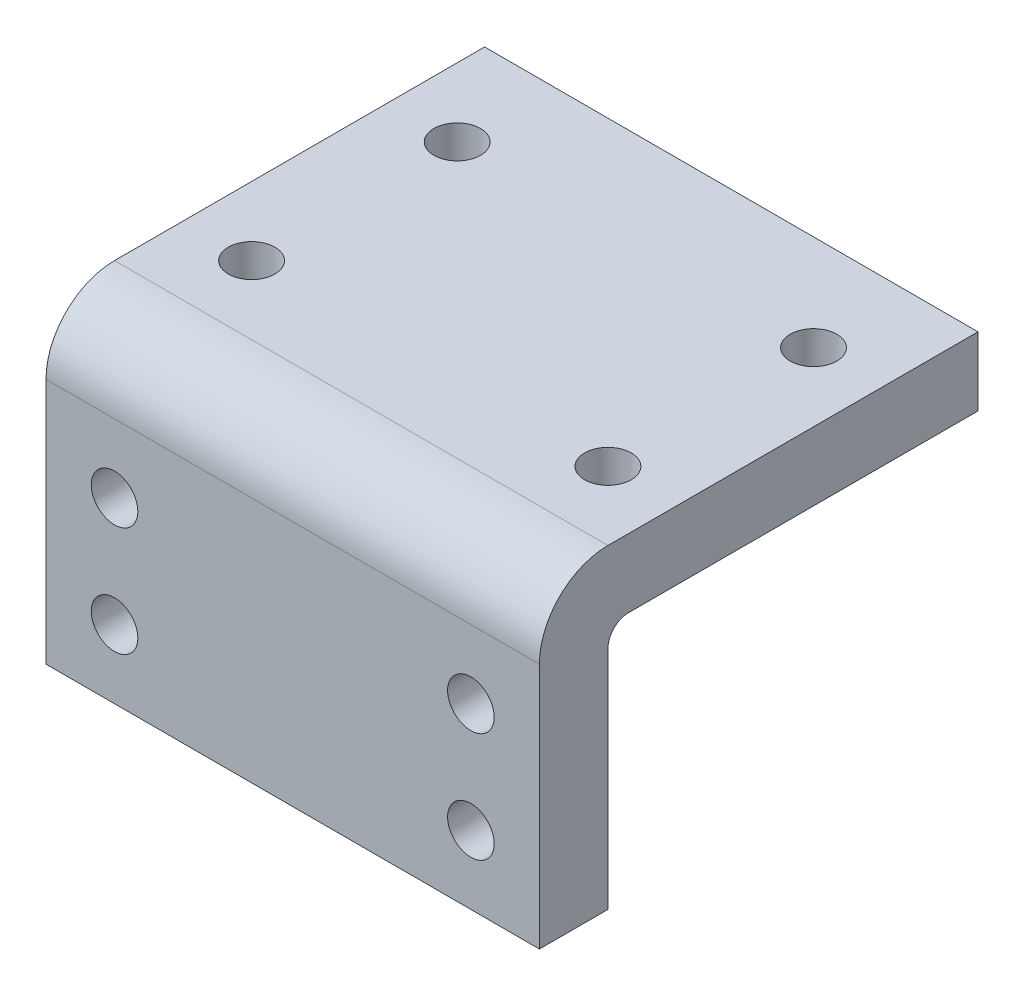
ISO-10303-21;
HEADER;
FILE_DESCRIPTION(('STEP AP214'),'2;1');
FILE_NAME('part.step','',(''),(''),'','','');
FILE_SCHEMA(('AUTOMOTIVE_DESIGN { 1 0 10303 214 1 1 1 1 }'));
ENDSEC;
DATA;
#1=APPLICATION_CONTEXT('core data for automotive mechanical design processes');
#2=APPLICATION_PROTOCOL_DEFINITION('international standard','automotive_design',2000,#1);
#3=PRODUCT_CONTEXT('',#1,'mechanical');
#4=PRODUCT('Part','Part','',(#3));
#5=PRODUCT_RELATED_PRODUCT_CATEGORY('part','',(#4));
#6=PRODUCT_DEFINITION_FORMATION('','',#4);
#7=PRODUCT_DEFINITION_CONTEXT('part definition',#1,'design');
#8=PRODUCT_DEFINITION('design','',#6,#7);
#9=PRODUCT_DEFINITION_SHAPE('','',#8);
#10=(LENGTH_UNIT() NAMED_UNIT(*) SI_UNIT(.MILLI.,.METRE.));
#11=(NAMED_UNIT(*) PLANE_ANGLE_UNIT() SI_UNIT($,.RADIAN.));
#12=(NAMED_UNIT(*) SI_UNIT($,.STERADIAN.) SOLID_ANGLE_UNIT());
#13=UNCERTAINTY_MEASURE_WITH_UNIT(LENGTH_MEASURE(1.E-05),#10,'distance_accuracy_value','');
#14=(GEOMETRIC_REPRESENTATION_CONTEXT(3) GLOBAL_UNCERTAINTY_ASSIGNED_CONTEXT((#13)) GLOBAL_UNIT_ASSIGNED_CONTEXT((#10,
#11,#12)) REPRESENTATION_CONTEXT('',''));
#15=CARTESIAN_POINT('',(0.,0.,0.));
#16=DIRECTION('',(0.,0.,1.));
#17=DIRECTION('',(1.,0.,0.));
#18=AXIS2_PLACEMENT_3D('',#15,#16,#17);
#19=CARTESIAN_POINT('',(0.,0.,0.));
#20=DIRECTION('',(0.,0.,1.));
#21=DIRECTION('',(1.,0.,0.));
#22=AXIS2_PLACEMENT_3D('',#19,#20,#21);
#23=PLANE('',#22);
#24=DIRECTION('',(0.,-1.,0.));
#25=VECTOR('',#24,1.);
#26=CARTESIAN_POINT('',(0.,18.,0.));
#27=LINE('',#26,#25);
#28=CARTESIAN_POINT('',(0.,16.5,0.));
#29=VERTEX_POINT('',#28);
#30=CARTESIAN_POINT('',(0.,0.,0.));
#31=VERTEX_POINT('',#30);
#32=EDGE_CURVE('E167',#29,#31,#27,.T.);
#33=ORIENTED_EDGE('',*,*,#32,.F.);
#34=DIRECTION('',(-1.,0.,0.));
#35=VECTOR('',#34,1.);
#36=CARTESIAN_POINT('',(0.,16.5,0.));
#37=LINE('',#36,#35);
#38=CARTESIAN_POINT('',(36.,16.5,0.));
#39=VERTEX_POINT('',#38);
#40=EDGE_CURVE('E189',#29,#39,#37,.F.);
#41=ORIENTED_EDGE('',*,*,#40,.T.);
#42=DIRECTION('',(0.,1.,0.));
#43=VECTOR('',#42,1.);
#44=CARTESIAN_POINT('',(36.,0.,0.));
#45=LINE('',#44,#43);
#46=CARTESIAN_POINT('',(36.,0.,0.));
#47=VERTEX_POINT('',#46);
#48=EDGE_CURVE('E171',#47,#39,#45,.T.);
#49=ORIENTED_EDGE('',*,*,#48,.F.);
#50=DIRECTION('',(1.,0.,0.));
#51=VECTOR('',#50,1.);
#52=CARTESIAN_POINT('',(0.,0.,0.));
#53=LINE('',#52,#51);
#54=EDGE_CURVE('E177',#31,#47,#53,.T.);
#55=ORIENTED_EDGE('',*,*,#54,.F.);
#56=EDGE_LOOP('',(#33,#41,#49,#55));
#57=FACE_BOUND('',#56,.T.);
#58=CARTESIAN_POINT('',(5.00000000000003,13.,0.));
#59=DIRECTION('',(0.,0.,-1.));
#60=DIRECTION('',(-1.,0.,0.));
#61=AXIS2_PLACEMENT_3D('',#58,#59,#60);
#62=CIRCLE('',#61,3.15);
#63=CARTESIAN_POINT('',(1.85000000000003,13.,0.));
#64=VERTEX_POINT('',#63);
#65=EDGE_CURVE('E158',#64,#64,#62,.T.);
#66=ORIENTED_EDGE('',*,*,#65,.F.);
#67=EDGE_LOOP('',(#66));
#68=FACE_BOUND('',#67,.T.);
#69=CARTESIAN_POINT('',(5.,5.,0.));
#70=DIRECTION('',(0.,0.,-1.));
#71=DIRECTION('',(-1.,0.,0.));
#72=AXIS2_PLACEMENT_3D('',#69,#70,#71);
#73=CIRCLE('',#72,3.15);
#74=CARTESIAN_POINT('',(1.85,5.,0.));
#75=VERTEX_POINT('',#74);
#76=EDGE_CURVE('E149',#75,#75,#73,.T.);
#77=ORIENTED_EDGE('',*,*,#76,.F.);
#78=EDGE_LOOP('',(#77));
#79=FACE_BOUND('',#78,.T.);
#80=CARTESIAN_POINT('',(31.,5.,0.));
#81=DIRECTION('',(0.,0.,-1.));
#82=DIRECTION('',(-1.,0.,0.));
#83=AXIS2_PLACEMENT_3D('',#80,#81,#82);
#84=CIRCLE('',#83,3.15);
#85=CARTESIAN_POINT('',(27.85,5.,0.));
#86=VERTEX_POINT('',#85);
#87=EDGE_CURVE('E140',#86,#86,#84,.T.);
#88=ORIENTED_EDGE('',*,*,#87,.F.);
#89=EDGE_LOOP('',(#88));
#90=FACE_BOUND('',#89,.T.);
#91=CARTESIAN_POINT('',(31.,13.,0.));
#92=DIRECTION('',(0.,0.,-1.));
#93=DIRECTION('',(-1.,0.,0.));
#94=AXIS2_PLACEMENT_3D('',#91,#92,#93);
#95=CIRCLE('',#94,3.15);
#96=CARTESIAN_POINT('',(27.85,13.,0.));
#97=VERTEX_POINT('',#96);
#98=EDGE_CURVE('E114',#97,#97,#95,.T.);
#99=ORIENTED_EDGE('',*,*,#98,.F.);
#100=EDGE_LOOP('',(#99));
#101=FACE_BOUND('',#100,.T.);
#102=ADVANCED_FACE('F33',(#57,#68,#79,#90,#101),#23,.F.);
#103=CARTESIAN_POINT('',(0.,18.,5.));
#104=DIRECTION('',(1.,0.,0.));
#105=DIRECTION('',(0.,1.,0.));
#106=AXIS2_PLACEMENT_3D('',#103,#104,#105);
#107=PLANE('',#106);
#108=DIRECTION('',(0.,-1.,0.));
#109=VECTOR('',#108,1.);
#110=CARTESIAN_POINT('',(0.,18.,5.));
#111=LINE('',#110,#109);
#112=CARTESIAN_POINT('',(0.,18.,5.));
#113=VERTEX_POINT('',#112);
#114=CARTESIAN_POINT('',(0.,0.,5.));
#115=VERTEX_POINT('',#114);
#116=EDGE_CURVE('E168',#113,#115,#111,.T.);
#117=ORIENTED_EDGE('',*,*,#116,.F.);
#118=CARTESIAN_POINT('',(0.,18.,0.));
#119=DIRECTION('',(1.,0.,0.));
#120=DIRECTION('',(0.,1.,0.));
#121=AXIS2_PLACEMENT_3D('',#118,#119,#120);
#122=CIRCLE('',#121,5.);
#123=CARTESIAN_POINT('',(0.,23.,0.));
#124=VERTEX_POINT('',#123);
#125=EDGE_CURVE('E11',#113,#124,#122,.F.);
#126=ORIENTED_EDGE('',*,*,#125,.T.);
#127=DIRECTION('',(0.,0.,1.));
#128=VECTOR('',#127,1.);
#129=CARTESIAN_POINT('',(0.,23.,5.));
#130=LINE('',#129,#128);
#131=CARTESIAN_POINT('',(0.,23.,-27.));
#132=VERTEX_POINT('',#131);
#133=EDGE_CURVE('E120',#132,#124,#130,.T.);
#134=ORIENTED_EDGE('',*,*,#133,.F.);
#135=DIRECTION('',(0.,-1.,0.));
#136=VECTOR('',#135,1.);
#137=CARTESIAN_POINT('',(0.,23.,-27.));
#138=LINE('',#137,#136);
#139=CARTESIAN_POINT('',(0.,18.,-27.));
#140=VERTEX_POINT('',#139);
#141=EDGE_CURVE('E115',#132,#140,#138,.T.);
#142=ORIENTED_EDGE('',*,*,#141,.T.);
#143=DIRECTION('',(0.,0.,1.));
#144=VECTOR('',#143,1.);
#145=CARTESIAN_POINT('',(0.,18.,5.));
#146=LINE('',#145,#144);
#147=CARTESIAN_POINT('',(0.,18.,-1.5));
#148=VERTEX_POINT('',#147);
#149=EDGE_CURVE('E105',#140,#148,#146,.T.);
#150=ORIENTED_EDGE('',*,*,#149,.T.);
#151=CARTESIAN_POINT('',(0.,16.5,-1.5));
#152=DIRECTION('',(1.,0.,0.));
#153=DIRECTION('',(0.,1.,0.));
#154=AXIS2_PLACEMENT_3D('',#151,#152,#153);
#155=CIRCLE('',#154,1.5);
#156=EDGE_CURVE('E191',#148,#29,#155,.T.);
#157=ORIENTED_EDGE('',*,*,#156,.T.);
#158=ORIENTED_EDGE('',*,*,#32,.T.);
#159=DIRECTION('',(0.,0.,-1.));
#160=VECTOR('',#159,1.);
#161=CARTESIAN_POINT('',(0.,0.,5.));
#162=LINE('',#161,#160);
#163=EDGE_CURVE('E183',#115,#31,#162,.T.);
#164=ORIENTED_EDGE('',*,*,#163,.F.);
#165=EDGE_LOOP('',(#117,#126,#134,#142,#150,#157,#158,#164));
#166=FACE_BOUND('',#165,.T.);
#167=ADVANCED_FACE('F207',(#166),#107,.F.);
#168=CARTESIAN_POINT('',(0.,0.,5.));
#169=DIRECTION('',(0.,1.,0.));
#170=DIRECTION('',(0.,0.,1.));
#171=AXIS2_PLACEMENT_3D('',#168,#169,#170);
#172=PLANE('',#171);
#173=ORIENTED_EDGE('',*,*,#54,.T.);
#174=DIRECTION('',(0.,0.,-1.));
#175=VECTOR('',#174,1.);
#176=CARTESIAN_POINT('',(36.,0.,5.));
#177=LINE('',#176,#175);
#178=CARTESIAN_POINT('',(36.,0.,5.));
#179=VERTEX_POINT('',#178);
#180=EDGE_CURVE('E175',#179,#47,#177,.T.);
#181=ORIENTED_EDGE('',*,*,#180,.F.);
#182=DIRECTION('',(1.,0.,0.));
#183=VECTOR('',#182,1.);
#184=CARTESIAN_POINT('',(0.,0.,5.));
#185=LINE('',#184,#183);
#186=EDGE_CURVE('E170',#115,#179,#185,.T.);
#187=ORIENTED_EDGE('',*,*,#186,.F.);
#188=ORIENTED_EDGE('',*,*,#163,.T.);
#189=EDGE_LOOP('',(#173,#181,#187,#188));
#190=FACE_BOUND('',#189,.T.);
#191=ADVANCED_FACE('F215',(#190),#172,.F.);
#192=CARTESIAN_POINT('',(36.,0.,5.));
#193=DIRECTION('',(-1.,0.,0.));
#194=DIRECTION('',(0.,0.,1.));
#195=AXIS2_PLACEMENT_3D('',#192,#193,#194);
#196=PLANE('',#195);
#197=DIRECTION('',(0.,0.,-1.));
#198=VECTOR('',#197,1.);
#199=CARTESIAN_POINT('',(36.,23.,-27.));
#200=LINE('',#199,#198);
#201=CARTESIAN_POINT('',(36.,23.,0.));
#202=VERTEX_POINT('',#201);
#203=CARTESIAN_POINT('',(36.,23.,-27.));
#204=VERTEX_POINT('',#203);
#205=EDGE_CURVE('E96',#202,#204,#200,.T.);
#206=ORIENTED_EDGE('',*,*,#205,.F.);
#207=CARTESIAN_POINT('',(36.,18.,0.));
#208=DIRECTION('',(-1.,0.,0.));
#209=DIRECTION('',(0.,0.,1.));
#210=AXIS2_PLACEMENT_3D('',#207,#208,#209);
#211=CIRCLE('',#210,5.);
#212=CARTESIAN_POINT('',(36.,18.,5.));
#213=VERTEX_POINT('',#212);
#214=EDGE_CURVE('E55',#202,#213,#211,.F.);
#215=ORIENTED_EDGE('',*,*,#214,.T.);
#216=DIRECTION('',(0.,1.,0.));
#217=VECTOR('',#216,1.);
#218=CARTESIAN_POINT('',(36.,0.,5.));
#219=LINE('',#218,#217);
#220=EDGE_CURVE('E173',#179,#213,#219,.T.);
#221=ORIENTED_EDGE('',*,*,#220,.F.);
#222=ORIENTED_EDGE('',*,*,#180,.T.);
#223=ORIENTED_EDGE('',*,*,#48,.T.);
#224=CARTESIAN_POINT('',(36.,16.5,-1.5));
#225=DIRECTION('',(-1.,0.,0.));
#226=DIRECTION('',(0.,0.,1.));
#227=AXIS2_PLACEMENT_3D('',#224,#225,#226);
#228=CIRCLE('',#227,1.5);
#229=CARTESIAN_POINT('',(36.,18.,-1.5));
#230=VERTEX_POINT('',#229);
#231=EDGE_CURVE('E193',#39,#230,#228,.T.);
#232=ORIENTED_EDGE('',*,*,#231,.T.);
#233=DIRECTION('',(0.,0.,-1.));
#234=VECTOR('',#233,1.);
#235=CARTESIAN_POINT('',(36.,18.,-27.));
#236=LINE('',#235,#234);
#237=CARTESIAN_POINT('',(36.,18.,-27.));
#238=VERTEX_POINT('',#237);
#239=EDGE_CURVE('E111',#230,#238,#236,.T.);
#240=ORIENTED_EDGE('',*,*,#239,.T.);
#241=DIRECTION('',(0.,-1.,0.));
#242=VECTOR('',#241,1.);
#243=CARTESIAN_POINT('',(36.,23.,-27.));
#244=LINE('',#243,#242);
#245=EDGE_CURVE('E108',#204,#238,#244,.T.);
#246=ORIENTED_EDGE('',*,*,#245,.F.);
#247=EDGE_LOOP('',(#206,#215,#221,#222,#223,#232,#240,#246));
#248=FACE_BOUND('',#247,.T.);
#249=ADVANCED_FACE('F109',(#248),#196,.F.);
#250=CARTESIAN_POINT('',(0.,0.,5.));
#251=DIRECTION('',(0.,0.,1.));
#252=DIRECTION('',(1.,0.,0.));
#253=AXIS2_PLACEMENT_3D('',#250,#251,#252);
#254=PLANE('',#253);
#255=CARTESIAN_POINT('',(31.,13.,5.));
#256=DIRECTION('',(0.,0.,1.));
#257=DIRECTION('',(1.,0.,0.));
#258=AXIS2_PLACEMENT_3D('',#255,#256,#257);
#259=CIRCLE('',#258,1.7);
#260=CARTESIAN_POINT('',(32.7,13.,5.));
#261=VERTEX_POINT('',#260);
#262=EDGE_CURVE('E137',#261,#261,#259,.T.);
#263=ORIENTED_EDGE('',*,*,#262,.F.);
#264=EDGE_LOOP('',(#263));
#265=FACE_BOUND('',#264,.T.);
#266=CARTESIAN_POINT('',(31.,5.,5.));
#267=DIRECTION('',(0.,0.,1.));
#268=DIRECTION('',(1.,0.,0.));
#269=AXIS2_PLACEMENT_3D('',#266,#267,#268);
#270=CIRCLE('',#269,1.7);
#271=CARTESIAN_POINT('',(32.7,5.,5.));
#272=VERTEX_POINT('',#271);
#273=EDGE_CURVE('E146',#272,#272,#270,.T.);
#274=ORIENTED_EDGE('',*,*,#273,.F.);
#275=EDGE_LOOP('',(#274));
#276=FACE_BOUND('',#275,.T.);
#277=CARTESIAN_POINT('',(5.,5.,5.));
#278=DIRECTION('',(0.,0.,1.));
#279=DIRECTION('',(1.,0.,0.));
#280=AXIS2_PLACEMENT_3D('',#277,#278,#279);
#281=CIRCLE('',#280,1.7);
#282=CARTESIAN_POINT('',(6.7,5.,5.));
#283=VERTEX_POINT('',#282);
#284=EDGE_CURVE('E155',#283,#283,#281,.T.);
#285=ORIENTED_EDGE('',*,*,#284,.F.);
#286=EDGE_LOOP('',(#285));
#287=FACE_BOUND('',#286,.T.);
#288=CARTESIAN_POINT('',(5.00000000000003,13.,5.));
#289=DIRECTION('',(0.,0.,1.));
#290=DIRECTION('',(1.,0.,0.));
#291=AXIS2_PLACEMENT_3D('',#288,#289,#290);
#292=CIRCLE('',#291,1.7);
#293=CARTESIAN_POINT('',(6.70000000000003,13.,5.));
#294=VERTEX_POINT('',#293);
#295=EDGE_CURVE('E164',#294,#294,#292,.T.);
#296=ORIENTED_EDGE('',*,*,#295,.F.);
#297=EDGE_LOOP('',(#296));
#298=FACE_BOUND('',#297,.T.);
#299=ORIENTED_EDGE('',*,*,#220,.T.);
#300=DIRECTION('',(1.,0.,0.));
#301=VECTOR('',#300,1.);
#302=CARTESIAN_POINT('',(0.,18.,5.));
#303=LINE('',#302,#301);
#304=EDGE_CURVE('E41',#213,#113,#303,.F.);
#305=ORIENTED_EDGE('',*,*,#304,.T.);
#306=ORIENTED_EDGE('',*,*,#116,.T.);
#307=ORIENTED_EDGE('',*,*,#186,.T.);
#308=EDGE_LOOP('',(#299,#305,#306,#307));
#309=FACE_BOUND('',#308,.T.);
#310=ADVANCED_FACE('F233',(#265,#276,#287,#298,#309),#254,.T.);
#311=CARTESIAN_POINT('',(5.00000000000003,13.,0.));
#312=DIRECTION('',(0.,0.,-1.));
#313=DIRECTION('',(-1.,0.,0.));
#314=AXIS2_PLACEMENT_3D('',#311,#312,#313);
#315=CYLINDRICAL_SURFACE('',#314,1.7);
#316=CARTESIAN_POINT('',(5.00000000000003,13.,1.45));
#317=DIRECTION('',(0.,0.,-1.));
#318=DIRECTION('',(-1.,0.,0.));
#319=AXIS2_PLACEMENT_3D('',#316,#317,#318);
#320=CIRCLE('',#319,1.7);
#321=CARTESIAN_POINT('',(3.30000000000003,13.,1.45));
#322=VERTEX_POINT('',#321);
#323=EDGE_CURVE('E161',#322,#322,#320,.T.);
#324=ORIENTED_EDGE('',*,*,#323,.T.);
#325=EDGE_LOOP('',(#324));
#326=FACE_BOUND('',#325,.T.);
#327=ORIENTED_EDGE('',*,*,#295,.T.);
#328=EDGE_LOOP('',(#327));
#329=FACE_BOUND('',#328,.T.);
#330=ADVANCED_FACE('F246',(#326,#329),#315,.F.);
#331=CARTESIAN_POINT('',(5.00000000000003,13.,0.));
#332=DIRECTION('',(0.,0.,-1.));
#333=DIRECTION('',(-1.,0.,0.));
#334=AXIS2_PLACEMENT_3D('',#331,#332,#333);
#335=CONICAL_SURFACE('',#334,3.15,0.785398163397447);
#336=ORIENTED_EDGE('',*,*,#323,.F.);
#337=EDGE_LOOP('',(#336));
#338=FACE_BOUND('',#337,.T.);
#339=ORIENTED_EDGE('',*,*,#65,.T.);
#340=EDGE_LOOP('',(#339));
#341=FACE_BOUND('',#340,.T.);
#342=ADVANCED_FACE('F249',(#338,#341),#335,.F.);
#343=CARTESIAN_POINT('',(5.,5.,0.));
#344=DIRECTION('',(0.,0.,-1.));
#345=DIRECTION('',(-1.,0.,0.));
#346=AXIS2_PLACEMENT_3D('',#343,#344,#345);
#347=CYLINDRICAL_SURFACE('',#346,1.7);
#348=CARTESIAN_POINT('',(5.,5.,1.45));
#349=DIRECTION('',(0.,0.,-1.));
#350=DIRECTION('',(-1.,0.,0.));
#351=AXIS2_PLACEMENT_3D('',#348,#349,#350);
#352=CIRCLE('',#351,1.7);
#353=CARTESIAN_POINT('',(3.3,5.,1.45));
#354=VERTEX_POINT('',#353);
#355=EDGE_CURVE('E152',#354,#354,#352,.T.);
#356=ORIENTED_EDGE('',*,*,#355,.T.);
#357=EDGE_LOOP('',(#356));
#358=FACE_BOUND('',#357,.T.);
#359=ORIENTED_EDGE('',*,*,#284,.T.);
#360=EDGE_LOOP('',(#359));
#361=FACE_BOUND('',#360,.T.);
#362=ADVANCED_FACE('F256',(#358,#361),#347,.F.);
#363=CARTESIAN_POINT('',(5.,5.,0.));
#364=DIRECTION('',(0.,0.,-1.));
#365=DIRECTION('',(-1.,0.,0.));
#366=AXIS2_PLACEMENT_3D('',#363,#364,#365);
#367=CONICAL_SURFACE('',#366,3.15,0.785398163397447);
#368=ORIENTED_EDGE('',*,*,#355,.F.);
#369=EDGE_LOOP('',(#368));
#370=FACE_BOUND('',#369,.T.);
#371=ORIENTED_EDGE('',*,*,#76,.T.);
#372=EDGE_LOOP('',(#371));
#373=FACE_BOUND('',#372,.T.);
#374=ADVANCED_FACE('F264',(#370,#373),#367,.F.);
#375=CARTESIAN_POINT('',(31.,5.,0.));
#376=DIRECTION('',(0.,0.,-1.));
#377=DIRECTION('',(-1.,0.,0.));
#378=AXIS2_PLACEMENT_3D('',#375,#376,#377);
#379=CYLINDRICAL_SURFACE('',#378,1.7);
#380=CARTESIAN_POINT('',(31.,5.,1.45));
#381=DIRECTION('',(0.,0.,-1.));
#382=DIRECTION('',(-1.,0.,0.));
#383=AXIS2_PLACEMENT_3D('',#380,#381,#382);
#384=CIRCLE('',#383,1.7);
#385=CARTESIAN_POINT('',(29.3,5.,1.45));
#386=VERTEX_POINT('',#385);
#387=EDGE_CURVE('E143',#386,#386,#384,.T.);
#388=ORIENTED_EDGE('',*,*,#387,.T.);
#389=EDGE_LOOP('',(#388));
#390=FACE_BOUND('',#389,.T.);
#391=ORIENTED_EDGE('',*,*,#273,.T.);
#392=EDGE_LOOP('',(#391));
#393=FACE_BOUND('',#392,.T.);
#394=ADVANCED_FACE('F272',(#390,#393),#379,.F.);
#395=CARTESIAN_POINT('',(31.,5.,0.));
#396=DIRECTION('',(0.,0.,-1.));
#397=DIRECTION('',(-1.,0.,0.));
#398=AXIS2_PLACEMENT_3D('',#395,#396,#397);
#399=CONICAL_SURFACE('',#398,3.15,0.78539816339745);
#400=ORIENTED_EDGE('',*,*,#387,.F.);
#401=EDGE_LOOP('',(#400));
#402=FACE_BOUND('',#401,.T.);
#403=ORIENTED_EDGE('',*,*,#87,.T.);
#404=EDGE_LOOP('',(#403));
#405=FACE_BOUND('',#404,.T.);
#406=ADVANCED_FACE('F280',(#402,#405),#399,.F.);
#407=CARTESIAN_POINT('',(31.,13.,0.));
#408=DIRECTION('',(0.,0.,-1.));
#409=DIRECTION('',(-1.,0.,0.));
#410=AXIS2_PLACEMENT_3D('',#407,#408,#409);
#411=CYLINDRICAL_SURFACE('',#410,1.7);
#412=CARTESIAN_POINT('',(31.,13.,1.45));
#413=DIRECTION('',(0.,0.,-1.));
#414=DIRECTION('',(-1.,0.,0.));
#415=AXIS2_PLACEMENT_3D('',#412,#413,#414);
#416=CIRCLE('',#415,1.7);
#417=CARTESIAN_POINT('',(29.3,13.,1.45));
#418=VERTEX_POINT('',#417);
#419=EDGE_CURVE('E134',#418,#418,#416,.T.);
#420=ORIENTED_EDGE('',*,*,#419,.T.);
#421=EDGE_LOOP('',(#420));
#422=FACE_BOUND('',#421,.T.);
#423=ORIENTED_EDGE('',*,*,#262,.T.);
#424=EDGE_LOOP('',(#423));
#425=FACE_BOUND('',#424,.T.);
#426=ADVANCED_FACE('F288',(#422,#425),#411,.F.);
#427=CARTESIAN_POINT('',(31.,13.,0.));
#428=DIRECTION('',(0.,0.,-1.));
#429=DIRECTION('',(-1.,0.,0.));
#430=AXIS2_PLACEMENT_3D('',#427,#428,#429);
#431=CONICAL_SURFACE('',#430,3.15,0.78539816339745);
#432=ORIENTED_EDGE('',*,*,#419,.F.);
#433=EDGE_LOOP('',(#432));
#434=FACE_BOUND('',#433,.T.);
#435=ORIENTED_EDGE('',*,*,#98,.T.);
#436=EDGE_LOOP('',(#435));
#437=FACE_BOUND('',#436,.T.);
#438=ADVANCED_FACE('F296',(#434,#437),#431,.F.);
#439=CARTESIAN_POINT('',(0.,23.,-27.));
#440=DIRECTION('',(0.,0.,1.));
#441=DIRECTION('',(1.,0.,0.));
#442=AXIS2_PLACEMENT_3D('',#439,#440,#441);
#443=PLANE('',#442);
#444=DIRECTION('',(-1.,0.,0.));
#445=VECTOR('',#444,1.);
#446=CARTESIAN_POINT('',(0.,18.,-27.));
#447=LINE('',#446,#445);
#448=EDGE_CURVE('E126',#238,#140,#447,.T.);
#449=ORIENTED_EDGE('',*,*,#448,.T.);
#450=ORIENTED_EDGE('',*,*,#141,.F.);
#451=DIRECTION('',(-1.,0.,0.));
#452=VECTOR('',#451,1.);
#453=CARTESIAN_POINT('',(0.,23.,-27.));
#454=LINE('',#453,#452);
#455=EDGE_CURVE('E101',#204,#132,#454,.T.);
#456=ORIENTED_EDGE('',*,*,#455,.F.);
#457=ORIENTED_EDGE('',*,*,#245,.T.);
#458=EDGE_LOOP('',(#449,#450,#456,#457));
#459=FACE_BOUND('',#458,.T.);
#460=ADVANCED_FACE('F117',(#459),#443,.F.);
#461=CARTESIAN_POINT('',(0.,23.,0.));
#462=DIRECTION('',(0.,-1.,0.));
#463=DIRECTION('',(1.,0.,0.));
#464=AXIS2_PLACEMENT_3D('',#461,#462,#463);
#465=PLANE('',#464);
#466=CARTESIAN_POINT('',(31.,23.,-5.));
#467=DIRECTION('',(0.,-1.,0.));
#468=DIRECTION('',(1.,0.,0.));
#469=AXIS2_PLACEMENT_3D('',#466,#467,#468);
#470=CIRCLE('',#469,1.69999999999999);
#471=CARTESIAN_POINT('',(32.7,23.,-5.));
#472=VERTEX_POINT('',#471);
#473=EDGE_CURVE('E477',#472,#472,#470,.T.);
#474=ORIENTED_EDGE('',*,*,#473,.T.);
#475=EDGE_LOOP('',(#474));
#476=FACE_BOUND('',#475,.T.);
#477=CARTESIAN_POINT('',(31.,23.,-20.));
#478=DIRECTION('',(0.,-1.,0.));
#479=DIRECTION('',(1.,0.,0.));
#480=AXIS2_PLACEMENT_3D('',#477,#478,#479);
#481=CIRCLE('',#480,1.69999999999999);
#482=CARTESIAN_POINT('',(32.7,23.,-20.));
#483=VERTEX_POINT('',#482);
#484=EDGE_CURVE('E488',#483,#483,#481,.T.);
#485=ORIENTED_EDGE('',*,*,#484,.T.);
#486=EDGE_LOOP('',(#485));
#487=FACE_BOUND('',#486,.T.);
#488=CARTESIAN_POINT('',(5.,23.,-20.));
#489=DIRECTION('',(0.,-1.,0.));
#490=DIRECTION('',(1.,0.,0.));
#491=AXIS2_PLACEMENT_3D('',#488,#489,#490);
#492=CIRCLE('',#491,1.69999999999999);
#493=CARTESIAN_POINT('',(6.69999999999999,23.,-20.));
#494=VERTEX_POINT('',#493);
#495=EDGE_CURVE('E497',#494,#494,#492,.T.);
#496=ORIENTED_EDGE('',*,*,#495,.T.);
#497=EDGE_LOOP('',(#496));
#498=FACE_BOUND('',#497,.T.);
#499=CARTESIAN_POINT('',(5.,23.,-5.));
#500=DIRECTION('',(0.,-1.,0.));
#501=DIRECTION('',(1.,0.,0.));
#502=AXIS2_PLACEMENT_3D('',#499,#500,#501);
#503=CIRCLE('',#502,1.69999999999999);
#504=CARTESIAN_POINT('',(6.69999999999999,23.,-5.));
#505=VERTEX_POINT('',#504);
#506=EDGE_CURVE('E127',#505,#505,#503,.T.);
#507=ORIENTED_EDGE('',*,*,#506,.T.);
#508=EDGE_LOOP('',(#507));
#509=FACE_BOUND('',#508,.T.);
#510=ORIENTED_EDGE('',*,*,#133,.T.);
#511=DIRECTION('',(1.,0.,0.));
#512=VECTOR('',#511,1.);
#513=CARTESIAN_POINT('',(36.,23.,0.));
#514=LINE('',#513,#512);
#515=EDGE_CURVE('E104',#124,#202,#514,.T.);
#516=ORIENTED_EDGE('',*,*,#515,.T.);
#517=ORIENTED_EDGE('',*,*,#205,.T.);
#518=ORIENTED_EDGE('',*,*,#455,.T.);
#519=EDGE_LOOP('',(#510,#516,#517,#518));
#520=FACE_BOUND('',#519,.T.);
#521=ADVANCED_FACE('F99',(#476,#487,#498,#509,#520),#465,.F.);
#522=CARTESIAN_POINT('',(0.,18.,0.));
#523=DIRECTION('',(0.,-1.,0.));
#524=DIRECTION('',(1.,0.,0.));
#525=AXIS2_PLACEMENT_3D('',#522,#523,#524);
#526=PLANE('',#525);
#527=CARTESIAN_POINT('',(31.,18.,-5.));
#528=DIRECTION('',(0.,-1.,0.));
#529=DIRECTION('',(0.,0.,-1.));
#530=AXIS2_PLACEMENT_3D('',#527,#528,#529);
#531=CIRCLE('',#530,3.15);
#532=CARTESIAN_POINT('',(31.,18.,-8.15));
#533=VERTEX_POINT('',#532);
#534=EDGE_CURVE('E475',#533,#533,#531,.T.);
#535=ORIENTED_EDGE('',*,*,#534,.F.);
#536=EDGE_LOOP('',(#535));
#537=FACE_BOUND('',#536,.T.);
#538=CARTESIAN_POINT('',(31.,18.,-20.));
#539=DIRECTION('',(0.,-1.,0.));
#540=DIRECTION('',(0.,0.,-1.));
#541=AXIS2_PLACEMENT_3D('',#538,#539,#540);
#542=CIRCLE('',#541,3.15);
#543=CARTESIAN_POINT('',(31.,18.,-23.15));
#544=VERTEX_POINT('',#543);
#545=EDGE_CURVE('E482',#544,#544,#542,.T.);
#546=ORIENTED_EDGE('',*,*,#545,.F.);
#547=EDGE_LOOP('',(#546));
#548=FACE_BOUND('',#547,.T.);
#549=CARTESIAN_POINT('',(5.,18.,-20.));
#550=DIRECTION('',(0.,-1.,0.));
#551=DIRECTION('',(0.,0.,-1.));
#552=AXIS2_PLACEMENT_3D('',#549,#550,#551);
#553=CIRCLE('',#552,3.15);
#554=CARTESIAN_POINT('',(5.,18.,-23.15));
#555=VERTEX_POINT('',#554);
#556=EDGE_CURVE('E491',#555,#555,#553,.T.);
#557=ORIENTED_EDGE('',*,*,#556,.F.);
#558=EDGE_LOOP('',(#557));
#559=FACE_BOUND('',#558,.T.);
#560=CARTESIAN_POINT('',(5.,18.,-5.));
#561=DIRECTION('',(0.,-1.,0.));
#562=DIRECTION('',(0.,0.,-1.));
#563=AXIS2_PLACEMENT_3D('',#560,#561,#562);
#564=CIRCLE('',#563,3.15);
#565=CARTESIAN_POINT('',(5.,18.,-8.15));
#566=VERTEX_POINT('',#565);
#567=EDGE_CURVE('E500',#566,#566,#564,.T.);
#568=ORIENTED_EDGE('',*,*,#567,.F.);
#569=EDGE_LOOP('',(#568));
#570=FACE_BOUND('',#569,.T.);
#571=ORIENTED_EDGE('',*,*,#239,.F.);
#572=DIRECTION('',(-1.,0.,0.));
#573=VECTOR('',#572,1.);
#574=CARTESIAN_POINT('',(0.,18.,-1.5));
#575=LINE('',#574,#573);
#576=EDGE_CURVE('E186',#230,#148,#575,.T.);
#577=ORIENTED_EDGE('',*,*,#576,.T.);
#578=ORIENTED_EDGE('',*,*,#149,.F.);
#579=ORIENTED_EDGE('',*,*,#448,.F.);
#580=EDGE_LOOP('',(#571,#577,#578,#579));
#581=FACE_BOUND('',#580,.T.);
#582=ADVANCED_FACE('F202',(#537,#548,#559,#570,#581),#526,.T.);
#583=CARTESIAN_POINT('',(5.,18.,-5.));
#584=DIRECTION('',(0.,-1.,0.));
#585=DIRECTION('',(0.,0.,-1.));
#586=AXIS2_PLACEMENT_3D('',#583,#584,#585);
#587=CYLINDRICAL_SURFACE('',#586,1.69999999999999);
#588=ORIENTED_EDGE('',*,*,#506,.F.);
#589=EDGE_LOOP('',(#588));
#590=FACE_BOUND('',#589,.T.);
#591=CARTESIAN_POINT('',(5.,19.45,-5.));
#592=DIRECTION('',(0.,-1.,0.));
#593=DIRECTION('',(0.,0.,-1.));
#594=AXIS2_PLACEMENT_3D('',#591,#592,#593);
#595=CIRCLE('',#594,1.69999999999999);
#596=CARTESIAN_POINT('',(5.,19.45,-6.69999999999998));
#597=VERTEX_POINT('',#596);
#598=EDGE_CURVE('E503',#597,#597,#595,.T.);
#599=ORIENTED_EDGE('',*,*,#598,.T.);
#600=EDGE_LOOP('',(#599));
#601=FACE_BOUND('',#600,.T.);
#602=ADVANCED_FACE('F339',(#590,#601),#587,.F.);
#603=CARTESIAN_POINT('',(5.,18.,-5.));
#604=DIRECTION('',(0.,-1.,0.));
#605=DIRECTION('',(0.,0.,-1.));
#606=AXIS2_PLACEMENT_3D('',#603,#604,#605);
#607=CONICAL_SURFACE('',#606,3.15,0.785398163397449);
#608=ORIENTED_EDGE('',*,*,#598,.F.);
#609=EDGE_LOOP('',(#608));
#610=FACE_BOUND('',#609,.T.);
#611=ORIENTED_EDGE('',*,*,#567,.T.);
#612=EDGE_LOOP('',(#611));
#613=FACE_BOUND('',#612,.T.);
#614=ADVANCED_FACE('F346',(#610,#613),#607,.F.);
#615=CARTESIAN_POINT('',(5.,18.,-20.));
#616=DIRECTION('',(0.,-1.,0.));
#617=DIRECTION('',(0.,0.,-1.));
#618=AXIS2_PLACEMENT_3D('',#615,#616,#617);
#619=CYLINDRICAL_SURFACE('',#618,1.69999999999999);
#620=ORIENTED_EDGE('',*,*,#495,.F.);
#621=EDGE_LOOP('',(#620));
#622=FACE_BOUND('',#621,.T.);
#623=CARTESIAN_POINT('',(5.,19.45,-20.));
#624=DIRECTION('',(0.,-1.,0.));
#625=DIRECTION('',(0.,0.,-1.));
#626=AXIS2_PLACEMENT_3D('',#623,#624,#625);
#627=CIRCLE('',#626,1.69999999999999);
#628=CARTESIAN_POINT('',(5.,19.45,-21.7));
#629=VERTEX_POINT('',#628);
#630=EDGE_CURVE('E494',#629,#629,#627,.T.);
#631=ORIENTED_EDGE('',*,*,#630,.T.);
#632=EDGE_LOOP('',(#631));
#633=FACE_BOUND('',#632,.T.);
#634=ADVANCED_FACE('F354',(#622,#633),#619,.F.);
#635=CARTESIAN_POINT('',(5.,18.,-20.));
#636=DIRECTION('',(0.,-1.,0.));
#637=DIRECTION('',(0.,0.,-1.));
#638=AXIS2_PLACEMENT_3D('',#635,#636,#637);
#639=CONICAL_SURFACE('',#638,3.15,0.785398163397449);
#640=ORIENTED_EDGE('',*,*,#630,.F.);
#641=EDGE_LOOP('',(#640));
#642=FACE_BOUND('',#641,.T.);
#643=ORIENTED_EDGE('',*,*,#556,.T.);
#644=EDGE_LOOP('',(#643));
#645=FACE_BOUND('',#644,.T.);
#646=ADVANCED_FACE('F362',(#642,#645),#639,.F.);
#647=CARTESIAN_POINT('',(31.,18.,-20.));
#648=DIRECTION('',(0.,-1.,0.));
#649=DIRECTION('',(0.,0.,-1.));
#650=AXIS2_PLACEMENT_3D('',#647,#648,#649);
#651=CYLINDRICAL_SURFACE('',#650,1.69999999999999);
#652=ORIENTED_EDGE('',*,*,#484,.F.);
#653=EDGE_LOOP('',(#652));
#654=FACE_BOUND('',#653,.T.);
#655=CARTESIAN_POINT('',(31.,19.45,-20.));
#656=DIRECTION('',(0.,-1.,0.));
#657=DIRECTION('',(0.,0.,-1.));
#658=AXIS2_PLACEMENT_3D('',#655,#656,#657);
#659=CIRCLE('',#658,1.69999999999999);
#660=CARTESIAN_POINT('',(31.,19.45,-21.7));
#661=VERTEX_POINT('',#660);
#662=EDGE_CURVE('E485',#661,#661,#659,.T.);
#663=ORIENTED_EDGE('',*,*,#662,.T.);
#664=EDGE_LOOP('',(#663));
#665=FACE_BOUND('',#664,.T.);
#666=ADVANCED_FACE('F370',(#654,#665),#651,.F.);
#667=CARTESIAN_POINT('',(31.,18.,-20.));
#668=DIRECTION('',(0.,-1.,0.));
#669=DIRECTION('',(0.,0.,-1.));
#670=AXIS2_PLACEMENT_3D('',#667,#668,#669);
#671=CONICAL_SURFACE('',#670,3.15,0.78539816339745);
#672=ORIENTED_EDGE('',*,*,#662,.F.);
#673=EDGE_LOOP('',(#672));
#674=FACE_BOUND('',#673,.T.);
#675=ORIENTED_EDGE('',*,*,#545,.T.);
#676=EDGE_LOOP('',(#675));
#677=FACE_BOUND('',#676,.T.);
#678=ADVANCED_FACE('F378',(#674,#677),#671,.F.);
#679=CARTESIAN_POINT('',(31.,18.,-5.));
#680=DIRECTION('',(0.,-1.,0.));
#681=DIRECTION('',(0.,0.,-1.));
#682=AXIS2_PLACEMENT_3D('',#679,#680,#681);
#683=CYLINDRICAL_SURFACE('',#682,1.69999999999999);
#684=ORIENTED_EDGE('',*,*,#473,.F.);
#685=EDGE_LOOP('',(#684));
#686=FACE_BOUND('',#685,.T.);
#687=CARTESIAN_POINT('',(31.,19.45,-5.));
#688=DIRECTION('',(0.,-1.,0.));
#689=DIRECTION('',(0.,0.,-1.));
#690=AXIS2_PLACEMENT_3D('',#687,#688,#689);
#691=CIRCLE('',#690,1.69999999999999);
#692=CARTESIAN_POINT('',(31.,19.45,-6.69999999999999));
#693=VERTEX_POINT('',#692);
#694=EDGE_CURVE('E472',#693,#693,#691,.T.);
#695=ORIENTED_EDGE('',*,*,#694,.T.);
#696=EDGE_LOOP('',(#695));
#697=FACE_BOUND('',#696,.T.);
#698=ADVANCED_FACE('F386',(#686,#697),#683,.F.);
#699=CARTESIAN_POINT('',(31.,18.,-5.));
#700=DIRECTION('',(0.,-1.,0.));
#701=DIRECTION('',(0.,0.,-1.));
#702=AXIS2_PLACEMENT_3D('',#699,#700,#701);
#703=CONICAL_SURFACE('',#702,3.15,0.78539816339745);
#704=ORIENTED_EDGE('',*,*,#694,.F.);
#705=EDGE_LOOP('',(#704));
#706=FACE_BOUND('',#705,.T.);
#707=ORIENTED_EDGE('',*,*,#534,.T.);
#708=EDGE_LOOP('',(#707));
#709=FACE_BOUND('',#708,.T.);
#710=ADVANCED_FACE('F222',(#706,#709),#703,.F.);
#711=CARTESIAN_POINT('',(0.,16.5,-1.5));
#712=DIRECTION('',(-1.,0.,0.));
#713=DIRECTION('',(0.,-1.,0.));
#714=AXIS2_PLACEMENT_3D('',#711,#712,#713);
#715=CYLINDRICAL_SURFACE('',#714,1.5);
#716=ORIENTED_EDGE('',*,*,#231,.F.);
#717=ORIENTED_EDGE('',*,*,#40,.F.);
#718=ORIENTED_EDGE('',*,*,#156,.F.);
#719=ORIENTED_EDGE('',*,*,#576,.F.);
#720=EDGE_LOOP('',(#716,#717,#718,#719));
#721=FACE_BOUND('',#720,.T.);
#722=ADVANCED_FACE('F204',(#721),#715,.F.);
#723=CARTESIAN_POINT('',(0.,18.,0.));
#724=DIRECTION('',(-1.,0.,0.));
#725=DIRECTION('',(0.,-1.,0.));
#726=AXIS2_PLACEMENT_3D('',#723,#724,#725);
#727=CYLINDRICAL_SURFACE('',#726,5.);
#728=ORIENTED_EDGE('',*,*,#125,.F.);
#729=ORIENTED_EDGE('',*,*,#304,.F.);
#730=ORIENTED_EDGE('',*,*,#214,.F.);
#731=ORIENTED_EDGE('',*,*,#515,.F.);
#732=EDGE_LOOP('',(#728,#729,#730,#731));
#733=FACE_BOUND('',#732,.T.);
#734=ADVANCED_FACE('F35',(#733),#727,.T.);
#735=CLOSED_SHELL('',(#102,#167,#191,#249,#310,#330,#342,#362,#374,#394,#406,#426,#438,#460,
#521,#582,#602,#614,#634,#646,#666,#678,#698,#710,#722,#734));
#736=MANIFOLD_SOLID_BREP('B2',#735);
#737=ADVANCED_BREP_SHAPE_REPRESENTATION('',(#18,#736),#14);
#738=SHAPE_DEFINITION_REPRESENTATION(#9,#737);
ENDSEC;
END-ISO-10303-21;
